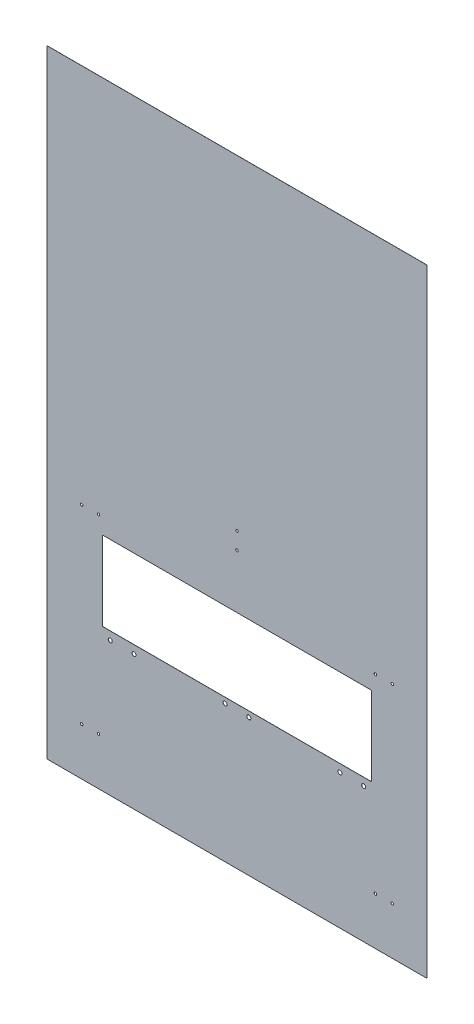
ISO-10303-21;
HEADER;
FILE_DESCRIPTION(('STEP AP214'),'2;1');
FILE_NAME('part.step','',(''),(''),'','','');
FILE_SCHEMA(('AUTOMOTIVE_DESIGN { 1 0 10303 214 1 1 1 1 }'));
ENDSEC;
DATA;
#1=APPLICATION_CONTEXT('core data for automotive mechanical design processes');
#2=APPLICATION_PROTOCOL_DEFINITION('international standard','automotive_design',2000,#1);
#3=PRODUCT_CONTEXT('',#1,'mechanical');
#4=PRODUCT('Part','Part','',(#3));
#5=PRODUCT_RELATED_PRODUCT_CATEGORY('part','',(#4));
#6=PRODUCT_DEFINITION_FORMATION('','',#4);
#7=PRODUCT_DEFINITION_CONTEXT('part definition',#1,'design');
#8=PRODUCT_DEFINITION('design','',#6,#7);
#9=PRODUCT_DEFINITION_SHAPE('','',#8);
#10=(LENGTH_UNIT() NAMED_UNIT(*) SI_UNIT(.MILLI.,.METRE.));
#11=(NAMED_UNIT(*) PLANE_ANGLE_UNIT() SI_UNIT($,.RADIAN.));
#12=(NAMED_UNIT(*) SI_UNIT($,.STERADIAN.) SOLID_ANGLE_UNIT());
#13=UNCERTAINTY_MEASURE_WITH_UNIT(LENGTH_MEASURE(1.E-05),#10,'distance_accuracy_value','');
#14=(GEOMETRIC_REPRESENTATION_CONTEXT(3) GLOBAL_UNCERTAINTY_ASSIGNED_CONTEXT((#13)) GLOBAL_UNIT_ASSIGNED_CONTEXT((#10,
#11,#12)) REPRESENTATION_CONTEXT('',''));
#15=CARTESIAN_POINT('',(0.,0.,0.));
#16=DIRECTION('',(0.,0.,1.));
#17=DIRECTION('',(1.,0.,0.));
#18=AXIS2_PLACEMENT_3D('',#15,#16,#17);
#19=CARTESIAN_POINT('',(0.,0.,6.35));
#20=DIRECTION('',(0.,0.,-1.));
#21=DIRECTION('',(-1.,0.,0.));
#22=AXIS2_PLACEMENT_3D('',#19,#20,#21);
#23=PLANE('',#22);
#24=CARTESIAN_POINT('',(111.5695,762.,6.35));
#25=DIRECTION('',(0.,0.,1.));
#26=DIRECTION('',(1.,0.,0.));
#27=AXIS2_PLACEMENT_3D('',#24,#25,#26);
#28=CIRCLE('',#27,3.96874999999999);
#29=CARTESIAN_POINT('',(115.53825,762.,6.35));
#30=VERTEX_POINT('',#29);
#31=EDGE_CURVE('E277',#30,#30,#28,.T.);
#32=ORIENTED_EDGE('',*,*,#31,.F.);
#33=EDGE_LOOP('',(#32));
#34=FACE_BOUND('',#33,.T.);
#35=CARTESIAN_POINT('',(111.5695,152.4,6.35));
#36=DIRECTION('',(0.,0.,1.));
#37=DIRECTION('',(1.,0.,0.));
#38=AXIS2_PLACEMENT_3D('',#35,#36,#37);
#39=CIRCLE('',#38,3.96874999999999);
#40=CARTESIAN_POINT('',(115.53825,152.4,6.35));
#41=VERTEX_POINT('',#40);
#42=EDGE_CURVE('E280',#41,#41,#39,.T.);
#43=ORIENTED_EDGE('',*,*,#42,.F.);
#44=EDGE_LOOP('',(#43));
#45=FACE_BOUND('',#44,.T.);
#46=CARTESIAN_POINT('',(165.5445,152.4,6.35));
#47=DIRECTION('',(0.,0.,1.));
#48=DIRECTION('',(1.,0.,0.));
#49=AXIS2_PLACEMENT_3D('',#46,#47,#48);
#50=CIRCLE('',#49,3.96874999999999);
#51=CARTESIAN_POINT('',(169.51325,152.4,6.35));
#52=VERTEX_POINT('',#51);
#53=EDGE_CURVE('E283',#52,#52,#50,.T.);
#54=ORIENTED_EDGE('',*,*,#53,.F.);
#55=EDGE_LOOP('',(#54));
#56=FACE_BOUND('',#55,.T.);
#57=CARTESIAN_POINT('',(165.5445,762.,6.35));
#58=DIRECTION('',(0.,0.,1.));
#59=DIRECTION('',(1.,0.,0.));
#60=AXIS2_PLACEMENT_3D('',#57,#58,#59);
#61=CIRCLE('',#60,3.96874999999999);
#62=CARTESIAN_POINT('',(169.51325,762.,6.35));
#63=VERTEX_POINT('',#62);
#64=EDGE_CURVE('E286',#63,#63,#61,.T.);
#65=ORIENTED_EDGE('',*,*,#64,.F.);
#66=EDGE_LOOP('',(#65));
#67=FACE_BOUND('',#66,.T.);
#68=CARTESIAN_POINT('',(1053.6555,152.4,6.35));
#69=DIRECTION('',(0.,0.,1.));
#70=DIRECTION('',(1.,0.,0.));
#71=AXIS2_PLACEMENT_3D('',#68,#69,#70);
#72=CIRCLE('',#71,3.96875000000008);
#73=CARTESIAN_POINT('',(1057.62425,152.4,6.35));
#74=VERTEX_POINT('',#73);
#75=EDGE_CURVE('E289',#74,#74,#72,.T.);
#76=ORIENTED_EDGE('',*,*,#75,.F.);
#77=EDGE_LOOP('',(#76));
#78=FACE_BOUND('',#77,.T.);
#79=CARTESIAN_POINT('',(1107.6305,152.4,6.35));
#80=DIRECTION('',(0.,0.,1.));
#81=DIRECTION('',(1.,0.,0.));
#82=AXIS2_PLACEMENT_3D('',#79,#80,#81);
#83=CIRCLE('',#82,3.96875000000008);
#84=CARTESIAN_POINT('',(1111.59925,152.4,6.35));
#85=VERTEX_POINT('',#84);
#86=EDGE_CURVE('E292',#85,#85,#83,.T.);
#87=ORIENTED_EDGE('',*,*,#86,.F.);
#88=EDGE_LOOP('',(#87));
#89=FACE_BOUND('',#88,.T.);
#90=CARTESIAN_POINT('',(1107.6305,762.,6.35));
#91=DIRECTION('',(0.,0.,1.));
#92=DIRECTION('',(1.,0.,0.));
#93=AXIS2_PLACEMENT_3D('',#90,#91,#92);
#94=CIRCLE('',#93,3.96875000000008);
#95=CARTESIAN_POINT('',(1111.59925,762.,6.35));
#96=VERTEX_POINT('',#95);
#97=EDGE_CURVE('E295',#96,#96,#94,.T.);
#98=ORIENTED_EDGE('',*,*,#97,.F.);
#99=EDGE_LOOP('',(#98));
#100=FACE_BOUND('',#99,.T.);
#101=CARTESIAN_POINT('',(1053.6555,762.,6.35));
#102=DIRECTION('',(0.,0.,1.));
#103=DIRECTION('',(1.,0.,0.));
#104=AXIS2_PLACEMENT_3D('',#101,#102,#103);
#105=CIRCLE('',#104,3.96875000000008);
#106=CARTESIAN_POINT('',(1057.62425,762.,6.35));
#107=VERTEX_POINT('',#106);
#108=EDGE_CURVE('E298',#107,#107,#105,.T.);
#109=ORIENTED_EDGE('',*,*,#108,.F.);
#110=EDGE_LOOP('',(#109));
#111=FACE_BOUND('',#110,.T.);
#112=CARTESIAN_POINT('',(609.6,884.2375,6.35));
#113=DIRECTION('',(0.,0.,1.));
#114=DIRECTION('',(1.,0.,0.));
#115=AXIS2_PLACEMENT_3D('',#112,#113,#114);
#116=CIRCLE('',#115,3.96874999999997);
#117=CARTESIAN_POINT('',(613.56875,884.2375,6.35));
#118=VERTEX_POINT('',#117);
#119=EDGE_CURVE('E301',#118,#118,#116,.T.);
#120=ORIENTED_EDGE('',*,*,#119,.F.);
#121=EDGE_LOOP('',(#120));
#122=FACE_BOUND('',#121,.T.);
#123=CARTESIAN_POINT('',(609.6,938.2125,6.35));
#124=DIRECTION('',(0.,0.,1.));
#125=DIRECTION('',(1.,0.,0.));
#126=AXIS2_PLACEMENT_3D('',#123,#124,#125);
#127=CIRCLE('',#126,3.96874999999997);
#128=CARTESIAN_POINT('',(613.56875,938.2125,6.35));
#129=VERTEX_POINT('',#128);
#130=EDGE_CURVE('E304',#129,#129,#127,.T.);
#131=ORIENTED_EDGE('',*,*,#130,.F.);
#132=EDGE_LOOP('',(#131));
#133=FACE_BOUND('',#132,.T.);
#134=CARTESIAN_POINT('',(203.200000000003,430.929767990845,6.35));
#135=DIRECTION('',(0.,0.,1.));
#136=DIRECTION('',(1.,0.,0.));
#137=AXIS2_PLACEMENT_3D('',#134,#135,#136);
#138=CIRCLE('',#137,6.4389);
#139=CARTESIAN_POINT('',(209.638900000003,430.929767990845,6.35));
#140=VERTEX_POINT('',#139);
#141=EDGE_CURVE('E307',#140,#140,#138,.T.);
#142=ORIENTED_EDGE('',*,*,#141,.F.);
#143=EDGE_LOOP('',(#142));
#144=FACE_BOUND('',#143,.T.);
#145=CARTESIAN_POINT('',(279.400000000004,430.929767990845,6.35));
#146=DIRECTION('',(0.,0.,1.));
#147=DIRECTION('',(1.,0.,0.));
#148=AXIS2_PLACEMENT_3D('',#145,#146,#147);
#149=CIRCLE('',#148,6.43890000000003);
#150=CARTESIAN_POINT('',(285.838900000004,430.929767990845,6.35));
#151=VERTEX_POINT('',#150);
#152=EDGE_CURVE('E310',#151,#151,#149,.T.);
#153=ORIENTED_EDGE('',*,*,#152,.F.);
#154=EDGE_LOOP('',(#153));
#155=FACE_BOUND('',#154,.T.);
#156=CARTESIAN_POINT('',(939.799999999995,432.537135513519,6.35));
#157=DIRECTION('',(0.,0.,1.));
#158=DIRECTION('',(1.,0.,0.));
#159=AXIS2_PLACEMENT_3D('',#156,#157,#158);
#160=CIRCLE('',#159,6.43890000000003);
#161=CARTESIAN_POINT('',(946.238899999995,432.537135513519,6.35));
#162=VERTEX_POINT('',#161);
#163=EDGE_CURVE('E313',#162,#162,#160,.T.);
#164=ORIENTED_EDGE('',*,*,#163,.F.);
#165=EDGE_LOOP('',(#164));
#166=FACE_BOUND('',#165,.T.);
#167=CARTESIAN_POINT('',(1015.99999999999,432.537135513518,6.35));
#168=DIRECTION('',(0.,0.,1.));
#169=DIRECTION('',(1.,0.,0.));
#170=AXIS2_PLACEMENT_3D('',#167,#168,#169);
#171=CIRCLE('',#170,6.43890000000003);
#172=CARTESIAN_POINT('',(1022.43889999999,432.537135513518,6.35));
#173=VERTEX_POINT('',#172);
#174=EDGE_CURVE('E316',#173,#173,#171,.T.);
#175=ORIENTED_EDGE('',*,*,#174,.F.);
#176=EDGE_LOOP('',(#175));
#177=FACE_BOUND('',#176,.T.);
#178=CARTESIAN_POINT('',(571.500000000004,439.533766845285,6.35));
#179=DIRECTION('',(0.,0.,1.));
#180=DIRECTION('',(1.,0.,0.));
#181=AXIS2_PLACEMENT_3D('',#178,#179,#180);
#182=CIRCLE('',#181,6.43890000000003);
#183=CARTESIAN_POINT('',(577.938900000004,439.533766845285,6.35));
#184=VERTEX_POINT('',#183);
#185=EDGE_CURVE('E319',#184,#184,#182,.T.);
#186=ORIENTED_EDGE('',*,*,#185,.F.);
#187=EDGE_LOOP('',(#186));
#188=FACE_BOUND('',#187,.T.);
#189=CARTESIAN_POINT('',(647.700000000004,439.533766845285,6.35));
#190=DIRECTION('',(0.,0.,1.));
#191=DIRECTION('',(1.,0.,0.));
#192=AXIS2_PLACEMENT_3D('',#189,#190,#191);
#193=CIRCLE('',#192,6.43890000000003);
#194=CARTESIAN_POINT('',(654.138900000004,439.533766845285,6.35));
#195=VERTEX_POINT('',#194);
#196=EDGE_CURVE('E234',#195,#195,#193,.T.);
#197=ORIENTED_EDGE('',*,*,#196,.F.);
#198=EDGE_LOOP('',(#197));
#199=FACE_BOUND('',#198,.T.);
#200=DIRECTION('',(0.,1.,0.));
#201=VECTOR('',#200,1.);
#202=CARTESIAN_POINT('',(1219.2,0.,6.35));
#203=LINE('',#202,#201);
#204=CARTESIAN_POINT('',(1219.2,3.175,6.35));
#205=VERTEX_POINT('',#204);
#206=CARTESIAN_POINT('',(1219.2,1978.025,6.35));
#207=VERTEX_POINT('',#206);
#208=EDGE_CURVE('E337',#205,#207,#203,.T.);
#209=ORIENTED_EDGE('',*,*,#208,.T.);
#210=CARTESIAN_POINT('',(1216.025,1978.025,6.35));
#211=DIRECTION('',(0.,0.,-1.));
#212=DIRECTION('',(-1.,0.,0.));
#213=AXIS2_PLACEMENT_3D('',#210,#211,#212);
#214=CIRCLE('',#213,3.175);
#215=CARTESIAN_POINT('',(1216.025,1981.2,6.35));
#216=VERTEX_POINT('',#215);
#217=EDGE_CURVE('E171',#207,#216,#214,.F.);
#218=ORIENTED_EDGE('',*,*,#217,.T.);
#219=DIRECTION('',(-1.,0.,0.));
#220=VECTOR('',#219,1.);
#221=CARTESIAN_POINT('',(0.,1981.2,6.35));
#222=LINE('',#221,#220);
#223=CARTESIAN_POINT('',(3.175,1981.2,6.35));
#224=VERTEX_POINT('',#223);
#225=EDGE_CURVE('E339',#216,#224,#222,.T.);
#226=ORIENTED_EDGE('',*,*,#225,.T.);
#227=CARTESIAN_POINT('',(3.175,1978.025,6.35));
#228=DIRECTION('',(0.,0.,-1.));
#229=DIRECTION('',(-1.,0.,0.));
#230=AXIS2_PLACEMENT_3D('',#227,#228,#229);
#231=CIRCLE('',#230,3.175);
#232=CARTESIAN_POINT('',(0.,1978.025,6.35));
#233=VERTEX_POINT('',#232);
#234=EDGE_CURVE('E181',#224,#233,#231,.F.);
#235=ORIENTED_EDGE('',*,*,#234,.T.);
#236=DIRECTION('',(0.,-1.,0.));
#237=VECTOR('',#236,1.);
#238=CARTESIAN_POINT('',(0.,0.,6.35));
#239=LINE('',#238,#237);
#240=CARTESIAN_POINT('',(0.,3.175,6.35));
#241=VERTEX_POINT('',#240);
#242=EDGE_CURVE('E331',#233,#241,#239,.T.);
#243=ORIENTED_EDGE('',*,*,#242,.T.);
#244=CARTESIAN_POINT('',(3.175,3.175,6.35));
#245=DIRECTION('',(0.,0.,-1.));
#246=DIRECTION('',(-1.,0.,0.));
#247=AXIS2_PLACEMENT_3D('',#244,#245,#246);
#248=CIRCLE('',#247,3.175);
#249=CARTESIAN_POINT('',(3.175,0.,6.35));
#250=VERTEX_POINT('',#249);
#251=EDGE_CURVE('E174',#241,#250,#248,.F.);
#252=ORIENTED_EDGE('',*,*,#251,.T.);
#253=DIRECTION('',(1.,0.,0.));
#254=VECTOR('',#253,1.);
#255=CARTESIAN_POINT('',(0.,0.,6.35));
#256=LINE('',#255,#254);
#257=CARTESIAN_POINT('',(1216.025,0.,6.35));
#258=VERTEX_POINT('',#257);
#259=EDGE_CURVE('E334',#250,#258,#256,.T.);
#260=ORIENTED_EDGE('',*,*,#259,.T.);
#261=CARTESIAN_POINT('',(1216.025,3.175,6.35));
#262=DIRECTION('',(0.,0.,-1.));
#263=DIRECTION('',(-1.,0.,0.));
#264=AXIS2_PLACEMENT_3D('',#261,#262,#263);
#265=CIRCLE('',#264,3.175);
#266=EDGE_CURVE('E172',#258,#205,#265,.F.);
#267=ORIENTED_EDGE('',*,*,#266,.T.);
#268=EDGE_LOOP('',(#209,#218,#226,#235,#243,#252,#260,#267));
#269=FACE_BOUND('',#268,.T.);
#270=DIRECTION('',(0.,-1.,0.));
#271=VECTOR('',#270,1.);
#272=CARTESIAN_POINT('',(177.8,457.2,6.35));
#273=LINE('',#272,#271);
#274=CARTESIAN_POINT('',(177.8,708.025,6.35));
#275=VERTEX_POINT('',#274);
#276=CARTESIAN_POINT('',(177.8,460.375,6.35));
#277=VERTEX_POINT('',#276);
#278=EDGE_CURVE('E223',#275,#277,#273,.T.);
#279=ORIENTED_EDGE('',*,*,#278,.F.);
#280=CARTESIAN_POINT('',(180.975,708.025,6.35));
#281=DIRECTION('',(0.,0.,-1.));
#282=DIRECTION('',(-1.,0.,0.));
#283=AXIS2_PLACEMENT_3D('',#280,#281,#282);
#284=CIRCLE('',#283,3.175);
#285=CARTESIAN_POINT('',(180.975,711.2,6.35));
#286=VERTEX_POINT('',#285);
#287=EDGE_CURVE('E11',#275,#286,#284,.T.);
#288=ORIENTED_EDGE('',*,*,#287,.T.);
#289=DIRECTION('',(-1.,0.,0.));
#290=VECTOR('',#289,1.);
#291=CARTESIAN_POINT('',(177.8,711.2,6.35));
#292=LINE('',#291,#290);
#293=CARTESIAN_POINT('',(1038.225,711.2,6.35));
#294=VERTEX_POINT('',#293);
#295=EDGE_CURVE('E328',#294,#286,#292,.T.);
#296=ORIENTED_EDGE('',*,*,#295,.F.);
#297=CARTESIAN_POINT('',(1038.225,708.025,6.35));
#298=DIRECTION('',(0.,0.,-1.));
#299=DIRECTION('',(-1.,0.,0.));
#300=AXIS2_PLACEMENT_3D('',#297,#298,#299);
#301=CIRCLE('',#300,3.175);
#302=CARTESIAN_POINT('',(1041.4,708.025,6.35));
#303=VERTEX_POINT('',#302);
#304=EDGE_CURVE('E216',#294,#303,#301,.T.);
#305=ORIENTED_EDGE('',*,*,#304,.T.);
#306=DIRECTION('',(0.,1.,0.));
#307=VECTOR('',#306,1.);
#308=CARTESIAN_POINT('',(1041.4,457.2,6.35));
#309=LINE('',#308,#307);
#310=CARTESIAN_POINT('',(1041.4,460.375,6.35));
#311=VERTEX_POINT('',#310);
#312=EDGE_CURVE('E325',#311,#303,#309,.T.);
#313=ORIENTED_EDGE('',*,*,#312,.F.);
#314=CARTESIAN_POINT('',(1038.225,460.375,6.35));
#315=DIRECTION('',(0.,0.,-1.));
#316=DIRECTION('',(-1.,0.,0.));
#317=AXIS2_PLACEMENT_3D('',#314,#315,#316);
#318=CIRCLE('',#317,3.175);
#319=CARTESIAN_POINT('',(1038.225,457.2,6.35));
#320=VERTEX_POINT('',#319);
#321=EDGE_CURVE('E214',#311,#320,#318,.T.);
#322=ORIENTED_EDGE('',*,*,#321,.T.);
#323=DIRECTION('',(1.,0.,0.));
#324=VECTOR('',#323,1.);
#325=CARTESIAN_POINT('',(177.8,457.2,6.35));
#326=LINE('',#325,#324);
#327=CARTESIAN_POINT('',(180.975,457.2,6.35));
#328=VERTEX_POINT('',#327);
#329=EDGE_CURVE('E226',#328,#320,#326,.T.);
#330=ORIENTED_EDGE('',*,*,#329,.F.);
#331=CARTESIAN_POINT('',(180.975,460.375,6.35));
#332=DIRECTION('',(0.,0.,-1.));
#333=DIRECTION('',(-1.,0.,0.));
#334=AXIS2_PLACEMENT_3D('',#331,#332,#333);
#335=CIRCLE('',#334,3.175);
#336=EDGE_CURVE('E45',#328,#277,#335,.T.);
#337=ORIENTED_EDGE('',*,*,#336,.T.);
#338=EDGE_LOOP('',(#279,#288,#296,#305,#313,#322,#330,#337));
#339=FACE_BOUND('',#338,.T.);
#340=ADVANCED_FACE('F36',(#34,#45,#56,#67,#78,#89,#100,#111,#122,#133,#144,#155,#166,#177,#188,
#199,#269,#339),#23,.F.);
#341=CARTESIAN_POINT('',(0.,0.,6.35));
#342=DIRECTION('',(1.,0.,0.));
#343=DIRECTION('',(0.,0.,-1.));
#344=AXIS2_PLACEMENT_3D('',#341,#342,#343);
#345=PLANE('',#344);
#346=DIRECTION('',(0.,0.,-1.));
#347=VECTOR('',#346,1.);
#348=CARTESIAN_POINT('',(0.,1978.025,6.35));
#349=LINE('',#348,#347);
#350=CARTESIAN_POINT('',(0.,1978.025,6.09599999999986));
#351=VERTEX_POINT('',#350);
#352=EDGE_CURVE('E186',#233,#351,#349,.T.);
#353=ORIENTED_EDGE('',*,*,#352,.T.);
#354=DIRECTION('',(0.,-1.,0.));
#355=VECTOR('',#354,1.);
#356=CARTESIAN_POINT('',(0.,1981.2,6.09599999999986));
#357=LINE('',#356,#355);
#358=CARTESIAN_POINT('',(0.,3.17499999999993,6.09599999999961));
#359=VERTEX_POINT('',#358);
#360=EDGE_CURVE('E167',#351,#359,#357,.T.);
#361=ORIENTED_EDGE('',*,*,#360,.T.);
#362=DIRECTION('',(0.,0.,-1.));
#363=VECTOR('',#362,1.);
#364=CARTESIAN_POINT('',(0.,3.175,6.35));
#365=LINE('',#364,#363);
#366=EDGE_CURVE('E184',#359,#241,#365,.F.);
#367=ORIENTED_EDGE('',*,*,#366,.T.);
#368=ORIENTED_EDGE('',*,*,#242,.F.);
#369=EDGE_LOOP('',(#353,#361,#367,#368));
#370=FACE_BOUND('',#369,.T.);
#371=ADVANCED_FACE('F356',(#370),#345,.F.);
#372=CARTESIAN_POINT('',(0.,0.,6.35));
#373=DIRECTION('',(0.,1.,0.));
#374=DIRECTION('',(0.,0.,1.));
#375=AXIS2_PLACEMENT_3D('',#372,#373,#374);
#376=PLANE('',#375);
#377=DIRECTION('',(0.,0.,-1.));
#378=VECTOR('',#377,1.);
#379=CARTESIAN_POINT('',(3.175,0.,6.35));
#380=LINE('',#379,#378);
#381=CARTESIAN_POINT('',(3.175,0.,6.09599999999961));
#382=VERTEX_POINT('',#381);
#383=EDGE_CURVE('E191',#250,#382,#380,.T.);
#384=ORIENTED_EDGE('',*,*,#383,.T.);
#385=DIRECTION('',(1.,0.,0.));
#386=VECTOR('',#385,1.);
#387=CARTESIAN_POINT('',(0.,0.,6.09599999999961));
#388=LINE('',#387,#386);
#389=CARTESIAN_POINT('',(1216.025,0.,6.09599999999961));
#390=VERTEX_POINT('',#389);
#391=EDGE_CURVE('E367',#382,#390,#388,.T.);
#392=ORIENTED_EDGE('',*,*,#391,.T.);
#393=DIRECTION('',(0.,0.,-1.));
#394=VECTOR('',#393,1.);
#395=CARTESIAN_POINT('',(1216.025,0.,6.35));
#396=LINE('',#395,#394);
#397=EDGE_CURVE('E189',#390,#258,#396,.F.);
#398=ORIENTED_EDGE('',*,*,#397,.T.);
#399=ORIENTED_EDGE('',*,*,#259,.F.);
#400=EDGE_LOOP('',(#384,#392,#398,#399));
#401=FACE_BOUND('',#400,.T.);
#402=ADVANCED_FACE('F366',(#401),#376,.F.);
#403=CARTESIAN_POINT('',(1219.2,0.,6.35));
#404=DIRECTION('',(-1.,0.,0.));
#405=DIRECTION('',(0.,0.,1.));
#406=AXIS2_PLACEMENT_3D('',#403,#404,#405);
#407=PLANE('',#406);
#408=DIRECTION('',(0.,0.,-1.));
#409=VECTOR('',#408,1.);
#410=CARTESIAN_POINT('',(1219.2,3.175,6.35));
#411=LINE('',#410,#409);
#412=CARTESIAN_POINT('',(1219.2,3.175,6.09599999999973));
#413=VERTEX_POINT('',#412);
#414=EDGE_CURVE('E166',#205,#413,#411,.T.);
#415=ORIENTED_EDGE('',*,*,#414,.T.);
#416=DIRECTION('',(0.,-1.,0.));
#417=VECTOR('',#416,1.);
#418=CARTESIAN_POINT('',(1219.2,1981.2,6.09599999999986));
#419=LINE('',#418,#417);
#420=CARTESIAN_POINT('',(1219.2,1978.025,6.09599999999986));
#421=VERTEX_POINT('',#420);
#422=EDGE_CURVE('E52',#421,#413,#419,.T.);
#423=ORIENTED_EDGE('',*,*,#422,.F.);
#424=DIRECTION('',(0.,0.,-1.));
#425=VECTOR('',#424,1.);
#426=CARTESIAN_POINT('',(1219.2,1978.025,6.35));
#427=LINE('',#426,#425);
#428=EDGE_CURVE('E163',#421,#207,#427,.F.);
#429=ORIENTED_EDGE('',*,*,#428,.T.);
#430=ORIENTED_EDGE('',*,*,#208,.F.);
#431=EDGE_LOOP('',(#415,#423,#429,#430));
#432=FACE_BOUND('',#431,.T.);
#433=ADVANCED_FACE('F161',(#432),#407,.F.);
#434=CARTESIAN_POINT('',(0.,1981.2,6.35));
#435=DIRECTION('',(0.,-1.,0.));
#436=DIRECTION('',(0.,0.,-1.));
#437=AXIS2_PLACEMENT_3D('',#434,#435,#436);
#438=PLANE('',#437);
#439=DIRECTION('',(0.,0.,-1.));
#440=VECTOR('',#439,1.);
#441=CARTESIAN_POINT('',(1216.025,1981.2,6.35));
#442=LINE('',#441,#440);
#443=CARTESIAN_POINT('',(1216.025,1981.2,6.09599999999986));
#444=VERTEX_POINT('',#443);
#445=EDGE_CURVE('E176',#216,#444,#442,.T.);
#446=ORIENTED_EDGE('',*,*,#445,.T.);
#447=DIRECTION('',(1.,0.,0.));
#448=VECTOR('',#447,1.);
#449=CARTESIAN_POINT('',(0.,1981.2,6.09599999999986));
#450=LINE('',#449,#448);
#451=CARTESIAN_POINT('',(3.175,1981.2,6.09599999999986));
#452=VERTEX_POINT('',#451);
#453=EDGE_CURVE('E151',#452,#444,#450,.T.);
#454=ORIENTED_EDGE('',*,*,#453,.F.);
#455=DIRECTION('',(0.,0.,-1.));
#456=VECTOR('',#455,1.);
#457=CARTESIAN_POINT('',(3.175,1981.2,6.35));
#458=LINE('',#457,#456);
#459=EDGE_CURVE('E342',#452,#224,#458,.F.);
#460=ORIENTED_EDGE('',*,*,#459,.T.);
#461=ORIENTED_EDGE('',*,*,#225,.F.);
#462=EDGE_LOOP('',(#446,#454,#460,#461));
#463=FACE_BOUND('',#462,.T.);
#464=ADVANCED_FACE('F345',(#463),#438,.F.);
#465=CARTESIAN_POINT('',(177.8,457.2,6.35));
#466=DIRECTION('',(1.,0.,0.));
#467=DIRECTION('',(0.,1.,0.));
#468=AXIS2_PLACEMENT_3D('',#465,#466,#467);
#469=PLANE('',#468);
#470=DIRECTION('',(0.,-1.,0.));
#471=VECTOR('',#470,1.);
#472=CARTESIAN_POINT('',(177.8,457.2,6.09599999999967));
#473=LINE('',#472,#471);
#474=CARTESIAN_POINT('',(177.8,708.025,6.0959999999997));
#475=VERTEX_POINT('',#474);
#476=CARTESIAN_POINT('',(177.8,460.375,6.09599999999967));
#477=VERTEX_POINT('',#476);
#478=EDGE_CURVE('E241',#475,#477,#473,.T.);
#479=ORIENTED_EDGE('',*,*,#478,.F.);
#480=DIRECTION('',(0.,0.,-1.));
#481=VECTOR('',#480,1.);
#482=CARTESIAN_POINT('',(177.8,708.025,6.35));
#483=LINE('',#482,#481);
#484=EDGE_CURVE('E209',#475,#275,#483,.F.);
#485=ORIENTED_EDGE('',*,*,#484,.T.);
#486=ORIENTED_EDGE('',*,*,#278,.T.);
#487=DIRECTION('',(0.,0.,-1.));
#488=VECTOR('',#487,1.);
#489=CARTESIAN_POINT('',(177.8,460.375,0.));
#490=LINE('',#489,#488);
#491=EDGE_CURVE('E211',#277,#477,#490,.T.);
#492=ORIENTED_EDGE('',*,*,#491,.T.);
#493=EDGE_LOOP('',(#479,#485,#486,#492));
#494=FACE_BOUND('',#493,.T.);
#495=ADVANCED_FACE('F232',(#494),#469,.T.);
#496=CARTESIAN_POINT('',(177.8,457.2,6.35));
#497=DIRECTION('',(0.,1.,0.));
#498=DIRECTION('',(0.,0.,1.));
#499=AXIS2_PLACEMENT_3D('',#496,#497,#498);
#500=PLANE('',#499);
#501=DIRECTION('',(1.,0.,0.));
#502=VECTOR('',#501,1.);
#503=CARTESIAN_POINT('',(177.8,457.2,6.09599999999967));
#504=LINE('',#503,#502);
#505=CARTESIAN_POINT('',(180.975,457.2,6.09599999999967));
#506=VERTEX_POINT('',#505);
#507=CARTESIAN_POINT('',(1038.225,457.2,6.09599999999967));
#508=VERTEX_POINT('',#507);
#509=EDGE_CURVE('E250',#506,#508,#504,.T.);
#510=ORIENTED_EDGE('',*,*,#509,.F.);
#511=DIRECTION('',(0.,0.,-1.));
#512=VECTOR('',#511,1.);
#513=CARTESIAN_POINT('',(180.975,457.2,6.35));
#514=LINE('',#513,#512);
#515=EDGE_CURVE('E194',#506,#328,#514,.F.);
#516=ORIENTED_EDGE('',*,*,#515,.T.);
#517=ORIENTED_EDGE('',*,*,#329,.T.);
#518=DIRECTION('',(0.,0.,-1.));
#519=VECTOR('',#518,1.);
#520=CARTESIAN_POINT('',(1038.225,457.2,0.));
#521=LINE('',#520,#519);
#522=EDGE_CURVE('E196',#320,#508,#521,.T.);
#523=ORIENTED_EDGE('',*,*,#522,.T.);
#524=EDGE_LOOP('',(#510,#516,#517,#523));
#525=FACE_BOUND('',#524,.T.);
#526=ADVANCED_FACE('F425',(#525),#500,.T.);
#527=CARTESIAN_POINT('',(1041.4,457.2,6.35));
#528=DIRECTION('',(-1.,0.,0.));
#529=DIRECTION('',(0.,0.,1.));
#530=AXIS2_PLACEMENT_3D('',#527,#528,#529);
#531=PLANE('',#530);
#532=DIRECTION('',(0.,1.,0.));
#533=VECTOR('',#532,1.);
#534=CARTESIAN_POINT('',(1041.4,457.2,6.09599999999967));
#535=LINE('',#534,#533);
#536=CARTESIAN_POINT('',(1041.4,460.375,6.09599999999967));
#537=VERTEX_POINT('',#536);
#538=CARTESIAN_POINT('',(1041.4,708.025,6.0959999999997));
#539=VERTEX_POINT('',#538);
#540=EDGE_CURVE('E244',#537,#539,#535,.T.);
#541=ORIENTED_EDGE('',*,*,#540,.F.);
#542=DIRECTION('',(0.,0.,-1.));
#543=VECTOR('',#542,1.);
#544=CARTESIAN_POINT('',(1041.4,460.375,6.35));
#545=LINE('',#544,#543);
#546=EDGE_CURVE('E202',#537,#311,#545,.F.);
#547=ORIENTED_EDGE('',*,*,#546,.T.);
#548=ORIENTED_EDGE('',*,*,#312,.T.);
#549=DIRECTION('',(0.,0.,-1.));
#550=VECTOR('',#549,1.);
#551=CARTESIAN_POINT('',(1041.4,708.025,0.));
#552=LINE('',#551,#550);
#553=EDGE_CURVE('E199',#303,#539,#552,.T.);
#554=ORIENTED_EDGE('',*,*,#553,.T.);
#555=EDGE_LOOP('',(#541,#547,#548,#554));
#556=FACE_BOUND('',#555,.T.);
#557=ADVANCED_FACE('F418',(#556),#531,.T.);
#558=CARTESIAN_POINT('',(177.8,711.2,6.35));
#559=DIRECTION('',(0.,-1.,0.));
#560=DIRECTION('',(0.,0.,-1.));
#561=AXIS2_PLACEMENT_3D('',#558,#559,#560);
#562=PLANE('',#561);
#563=DIRECTION('',(-1.,0.,0.));
#564=VECTOR('',#563,1.);
#565=CARTESIAN_POINT('',(177.8,711.2,6.0959999999997));
#566=LINE('',#565,#564);
#567=CARTESIAN_POINT('',(1038.225,711.2,6.0959999999997));
#568=VERTEX_POINT('',#567);
#569=CARTESIAN_POINT('',(180.975,711.2,6.0959999999997));
#570=VERTEX_POINT('',#569);
#571=EDGE_CURVE('E60',#568,#570,#566,.T.);
#572=ORIENTED_EDGE('',*,*,#571,.F.);
#573=DIRECTION('',(0.,0.,-1.));
#574=VECTOR('',#573,1.);
#575=CARTESIAN_POINT('',(1038.225,711.2,6.35));
#576=LINE('',#575,#574);
#577=EDGE_CURVE('E207',#568,#294,#576,.F.);
#578=ORIENTED_EDGE('',*,*,#577,.T.);
#579=ORIENTED_EDGE('',*,*,#295,.T.);
#580=DIRECTION('',(0.,0.,-1.));
#581=VECTOR('',#580,1.);
#582=CARTESIAN_POINT('',(180.975,711.2,0.));
#583=LINE('',#582,#581);
#584=EDGE_CURVE('E204',#286,#570,#583,.T.);
#585=ORIENTED_EDGE('',*,*,#584,.T.);
#586=EDGE_LOOP('',(#572,#578,#579,#585));
#587=FACE_BOUND('',#586,.T.);
#588=ADVANCED_FACE('F408',(#587),#562,.T.);
#589=CARTESIAN_POINT('',(647.700000000004,439.533766845285,6.35));
#590=DIRECTION('',(0.,0.,1.));
#591=DIRECTION('',(1.,0.,0.));
#592=AXIS2_PLACEMENT_3D('',#589,#590,#591);
#593=CONICAL_SURFACE('',#592,6.43890000000003,0.715584993317683);
#594=CARTESIAN_POINT('',(647.700000000004,439.533766845285,6.09599999999967));
#595=DIRECTION('',(0.,0.,1.));
#596=DIRECTION('',(0.,-1.,0.));
#597=AXIS2_PLACEMENT_3D('',#594,#595,#596);
#598=CIRCLE('',#597,6.21810116859441);
#599=CARTESIAN_POINT('',(647.700000000004,433.315665676691,6.09599999999967));
#600=VERTEX_POINT('',#599);
#601=EDGE_CURVE('E274',#600,#600,#598,.F.);
#602=ORIENTED_EDGE('',*,*,#601,.T.);
#603=EDGE_LOOP('',(#602));
#604=FACE_BOUND('',#603,.T.);
#605=ORIENTED_EDGE('',*,*,#196,.T.);
#606=EDGE_LOOP('',(#605));
#607=FACE_BOUND('',#606,.T.);
#608=ADVANCED_FACE('F437',(#604,#607),#593,.F.);
#609=CARTESIAN_POINT('',(571.500000000004,439.533766845285,6.35));
#610=DIRECTION('',(0.,0.,1.));
#611=DIRECTION('',(1.,0.,0.));
#612=AXIS2_PLACEMENT_3D('',#609,#610,#611);
#613=CONICAL_SURFACE('',#612,6.43890000000003,0.715584993317683);
#614=CARTESIAN_POINT('',(571.500000000004,439.533766845285,6.09599999999967));
#615=DIRECTION('',(0.,0.,1.));
#616=DIRECTION('',(0.,-1.,0.));
#617=AXIS2_PLACEMENT_3D('',#614,#615,#616);
#618=CIRCLE('',#617,6.21810116859441);
#619=CARTESIAN_POINT('',(571.500000000004,433.315665676691,6.09599999999967));
#620=VERTEX_POINT('',#619);
#621=EDGE_CURVE('E271',#620,#620,#618,.F.);
#622=ORIENTED_EDGE('',*,*,#621,.T.);
#623=EDGE_LOOP('',(#622));
#624=FACE_BOUND('',#623,.T.);
#625=ORIENTED_EDGE('',*,*,#185,.T.);
#626=EDGE_LOOP('',(#625));
#627=FACE_BOUND('',#626,.T.);
#628=ADVANCED_FACE('F440',(#624,#627),#613,.F.);
#629=CARTESIAN_POINT('',(1015.99999999999,432.537135513518,6.35));
#630=DIRECTION('',(0.,0.,1.));
#631=DIRECTION('',(1.,0.,0.));
#632=AXIS2_PLACEMENT_3D('',#629,#630,#631);
#633=CONICAL_SURFACE('',#632,6.43890000000003,0.715584993317664);
#634=CARTESIAN_POINT('',(1015.99999999999,432.537135513518,6.09599999999967));
#635=DIRECTION('',(0.,0.,1.));
#636=DIRECTION('',(0.,-1.,0.));
#637=AXIS2_PLACEMENT_3D('',#634,#635,#636);
#638=CIRCLE('',#637,6.21810116859442);
#639=CARTESIAN_POINT('',(1015.99999999999,426.319034344924,6.09599999999967));
#640=VERTEX_POINT('',#639);
#641=EDGE_CURVE('E268',#640,#640,#638,.F.);
#642=ORIENTED_EDGE('',*,*,#641,.T.);
#643=EDGE_LOOP('',(#642));
#644=FACE_BOUND('',#643,.T.);
#645=ORIENTED_EDGE('',*,*,#174,.T.);
#646=EDGE_LOOP('',(#645));
#647=FACE_BOUND('',#646,.T.);
#648=ADVANCED_FACE('F506',(#644,#647),#633,.F.);
#649=CARTESIAN_POINT('',(939.799999999995,432.537135513519,6.35));
#650=DIRECTION('',(0.,0.,1.));
#651=DIRECTION('',(1.,0.,0.));
#652=AXIS2_PLACEMENT_3D('',#649,#650,#651);
#653=CONICAL_SURFACE('',#652,6.43890000000003,0.715584993317683);
#654=CARTESIAN_POINT('',(939.799999999995,432.537135513519,6.09599999999967));
#655=DIRECTION('',(0.,0.,1.));
#656=DIRECTION('',(0.,-1.,0.));
#657=AXIS2_PLACEMENT_3D('',#654,#655,#656);
#658=CIRCLE('',#657,6.21810116859441);
#659=CARTESIAN_POINT('',(939.799999999995,426.319034344924,6.09599999999967));
#660=VERTEX_POINT('',#659);
#661=EDGE_CURVE('E265',#660,#660,#658,.F.);
#662=ORIENTED_EDGE('',*,*,#661,.T.);
#663=EDGE_LOOP('',(#662));
#664=FACE_BOUND('',#663,.T.);
#665=ORIENTED_EDGE('',*,*,#163,.T.);
#666=EDGE_LOOP('',(#665));
#667=FACE_BOUND('',#666,.T.);
#668=ADVANCED_FACE('F502',(#664,#667),#653,.F.);
#669=CARTESIAN_POINT('',(279.400000000004,430.929767990845,6.35));
#670=DIRECTION('',(0.,0.,1.));
#671=DIRECTION('',(1.,0.,0.));
#672=AXIS2_PLACEMENT_3D('',#669,#670,#671);
#673=CONICAL_SURFACE('',#672,6.43890000000003,0.715584993317683);
#674=CARTESIAN_POINT('',(279.400000000004,430.929767990845,6.09599999999967));
#675=DIRECTION('',(0.,0.,1.));
#676=DIRECTION('',(0.,-1.,0.));
#677=AXIS2_PLACEMENT_3D('',#674,#675,#676);
#678=CIRCLE('',#677,6.21810116859441);
#679=CARTESIAN_POINT('',(279.400000000004,424.711666822251,6.09599999999967));
#680=VERTEX_POINT('',#679);
#681=EDGE_CURVE('E262',#680,#680,#678,.F.);
#682=ORIENTED_EDGE('',*,*,#681,.T.);
#683=EDGE_LOOP('',(#682));
#684=FACE_BOUND('',#683,.T.);
#685=ORIENTED_EDGE('',*,*,#152,.T.);
#686=EDGE_LOOP('',(#685));
#687=FACE_BOUND('',#686,.T.);
#688=ADVANCED_FACE('F498',(#684,#687),#673,.F.);
#689=CARTESIAN_POINT('',(203.200000000003,430.929767990845,6.35));
#690=DIRECTION('',(0.,0.,1.));
#691=DIRECTION('',(1.,0.,0.));
#692=AXIS2_PLACEMENT_3D('',#689,#690,#691);
#693=CONICAL_SURFACE('',#692,6.4389,0.715584993317674);
#694=CARTESIAN_POINT('',(203.200000000003,430.929767990845,6.09599999999967));
#695=DIRECTION('',(0.,0.,1.));
#696=DIRECTION('',(0.,-1.,0.));
#697=AXIS2_PLACEMENT_3D('',#694,#695,#696);
#698=CIRCLE('',#697,6.21810116859438);
#699=CARTESIAN_POINT('',(203.200000000003,424.711666822251,6.09599999999967));
#700=VERTEX_POINT('',#699);
#701=EDGE_CURVE('E156',#700,#700,#698,.F.);
#702=ORIENTED_EDGE('',*,*,#701,.T.);
#703=EDGE_LOOP('',(#702));
#704=FACE_BOUND('',#703,.T.);
#705=ORIENTED_EDGE('',*,*,#141,.T.);
#706=EDGE_LOOP('',(#705));
#707=FACE_BOUND('',#706,.T.);
#708=ADVANCED_FACE('F466',(#704,#707),#693,.F.);
#709=CARTESIAN_POINT('',(1216.025,1978.025,6.35));
#710=DIRECTION('',(0.,0.,-1.));
#711=DIRECTION('',(-1.,0.,0.));
#712=AXIS2_PLACEMENT_3D('',#709,#710,#711);
#713=CYLINDRICAL_SURFACE('',#712,3.175);
#714=CARTESIAN_POINT('',(1216.025,1978.025,6.09599999999986));
#715=DIRECTION('',(0.,0.,1.));
#716=DIRECTION('',(0.,-1.,0.));
#717=AXIS2_PLACEMENT_3D('',#714,#715,#716);
#718=CIRCLE('',#717,3.175);
#719=EDGE_CURVE('E147',#444,#421,#718,.F.);
#720=ORIENTED_EDGE('',*,*,#719,.F.);
#721=ORIENTED_EDGE('',*,*,#445,.F.);
#722=ORIENTED_EDGE('',*,*,#217,.F.);
#723=ORIENTED_EDGE('',*,*,#428,.F.);
#724=EDGE_LOOP('',(#720,#721,#722,#723));
#725=FACE_BOUND('',#724,.T.);
#726=ADVANCED_FACE('F170',(#725),#713,.T.);
#727=CARTESIAN_POINT('',(3.175,1978.025,6.35));
#728=DIRECTION('',(0.,0.,-1.));
#729=DIRECTION('',(-1.,0.,0.));
#730=AXIS2_PLACEMENT_3D('',#727,#728,#729);
#731=CYLINDRICAL_SURFACE('',#730,3.175);
#732=CARTESIAN_POINT('',(3.175,1978.025,6.09599999999986));
#733=DIRECTION('',(0.,0.,1.));
#734=DIRECTION('',(0.,-1.,0.));
#735=AXIS2_PLACEMENT_3D('',#732,#733,#734);
#736=CIRCLE('',#735,3.175);
#737=EDGE_CURVE('E157',#351,#452,#736,.F.);
#738=ORIENTED_EDGE('',*,*,#737,.F.);
#739=ORIENTED_EDGE('',*,*,#352,.F.);
#740=ORIENTED_EDGE('',*,*,#234,.F.);
#741=ORIENTED_EDGE('',*,*,#459,.F.);
#742=EDGE_LOOP('',(#738,#739,#740,#741));
#743=FACE_BOUND('',#742,.T.);
#744=ADVANCED_FACE('F353',(#743),#731,.T.);
#745=CARTESIAN_POINT('',(3.175,3.175,6.35));
#746=DIRECTION('',(0.,0.,-1.));
#747=DIRECTION('',(-1.,0.,0.));
#748=AXIS2_PLACEMENT_3D('',#745,#746,#747);
#749=CYLINDRICAL_SURFACE('',#748,3.175);
#750=CARTESIAN_POINT('',(3.175,3.175,6.09599999999961));
#751=DIRECTION('',(0.,0.,1.));
#752=DIRECTION('',(0.,-1.,0.));
#753=AXIS2_PLACEMENT_3D('',#750,#751,#752);
#754=CIRCLE('',#753,3.175);
#755=EDGE_CURVE('E257',#382,#359,#754,.F.);
#756=ORIENTED_EDGE('',*,*,#755,.F.);
#757=ORIENTED_EDGE('',*,*,#383,.F.);
#758=ORIENTED_EDGE('',*,*,#251,.F.);
#759=ORIENTED_EDGE('',*,*,#366,.F.);
#760=EDGE_LOOP('',(#756,#757,#758,#759));
#761=FACE_BOUND('',#760,.T.);
#762=ADVANCED_FACE('F363',(#761),#749,.T.);
#763=CARTESIAN_POINT('',(1216.025,3.175,6.35));
#764=DIRECTION('',(0.,0.,-1.));
#765=DIRECTION('',(-1.,0.,0.));
#766=AXIS2_PLACEMENT_3D('',#763,#764,#765);
#767=CYLINDRICAL_SURFACE('',#766,3.175);
#768=CARTESIAN_POINT('',(1216.025,3.175,6.09599999999961));
#769=DIRECTION('',(0.,0.,1.));
#770=DIRECTION('',(0.,-1.,0.));
#771=AXIS2_PLACEMENT_3D('',#768,#769,#770);
#772=CIRCLE('',#771,3.175);
#773=EDGE_CURVE('E255',#413,#390,#772,.F.);
#774=ORIENTED_EDGE('',*,*,#773,.F.);
#775=ORIENTED_EDGE('',*,*,#414,.F.);
#776=ORIENTED_EDGE('',*,*,#266,.F.);
#777=ORIENTED_EDGE('',*,*,#397,.F.);
#778=EDGE_LOOP('',(#774,#775,#776,#777));
#779=FACE_BOUND('',#778,.T.);
#780=ADVANCED_FACE('F371',(#779),#767,.T.);
#781=CARTESIAN_POINT('',(1038.225,460.375,6.35));
#782=DIRECTION('',(0.,0.,1.));
#783=DIRECTION('',(1.,0.,0.));
#784=AXIS2_PLACEMENT_3D('',#781,#782,#783);
#785=CYLINDRICAL_SURFACE('',#784,3.175);
#786=ORIENTED_EDGE('',*,*,#546,.F.);
#787=CARTESIAN_POINT('',(1038.225,460.375,6.09599999999967));
#788=DIRECTION('',(0.,0.,1.));
#789=DIRECTION('',(0.,-1.,0.));
#790=AXIS2_PLACEMENT_3D('',#787,#788,#789);
#791=CIRCLE('',#790,3.175);
#792=EDGE_CURVE('E252',#537,#508,#791,.F.);
#793=ORIENTED_EDGE('',*,*,#792,.T.);
#794=ORIENTED_EDGE('',*,*,#522,.F.);
#795=ORIENTED_EDGE('',*,*,#321,.F.);
#796=EDGE_LOOP('',(#786,#793,#794,#795));
#797=FACE_BOUND('',#796,.T.);
#798=ADVANCED_FACE('F423',(#797),#785,.F.);
#799=CARTESIAN_POINT('',(1038.225,708.025,6.35));
#800=DIRECTION('',(0.,0.,1.));
#801=DIRECTION('',(1.,0.,0.));
#802=AXIS2_PLACEMENT_3D('',#799,#800,#801);
#803=CYLINDRICAL_SURFACE('',#802,3.175);
#804=ORIENTED_EDGE('',*,*,#577,.F.);
#805=CARTESIAN_POINT('',(1038.225,708.025,6.0959999999997));
#806=DIRECTION('',(0.,0.,1.));
#807=DIRECTION('',(0.,-1.,0.));
#808=AXIS2_PLACEMENT_3D('',#805,#806,#807);
#809=CIRCLE('',#808,3.175);
#810=EDGE_CURVE('E240',#568,#539,#809,.F.);
#811=ORIENTED_EDGE('',*,*,#810,.T.);
#812=ORIENTED_EDGE('',*,*,#553,.F.);
#813=ORIENTED_EDGE('',*,*,#304,.F.);
#814=EDGE_LOOP('',(#804,#811,#812,#813));
#815=FACE_BOUND('',#814,.T.);
#816=ADVANCED_FACE('F415',(#815),#803,.F.);
#817=CARTESIAN_POINT('',(180.975,460.375,6.35));
#818=DIRECTION('',(0.,0.,1.));
#819=DIRECTION('',(1.,0.,0.));
#820=AXIS2_PLACEMENT_3D('',#817,#818,#819);
#821=CYLINDRICAL_SURFACE('',#820,3.175);
#822=ORIENTED_EDGE('',*,*,#515,.F.);
#823=CARTESIAN_POINT('',(180.975,460.375,6.09599999999967));
#824=DIRECTION('',(0.,0.,1.));
#825=DIRECTION('',(0.,-1.,0.));
#826=AXIS2_PLACEMENT_3D('',#823,#824,#825);
#827=CIRCLE('',#826,3.175);
#828=EDGE_CURVE('E238',#506,#477,#827,.F.);
#829=ORIENTED_EDGE('',*,*,#828,.T.);
#830=ORIENTED_EDGE('',*,*,#491,.F.);
#831=ORIENTED_EDGE('',*,*,#336,.F.);
#832=EDGE_LOOP('',(#822,#829,#830,#831));
#833=FACE_BOUND('',#832,.T.);
#834=ADVANCED_FACE('F237',(#833),#821,.F.);
#835=CARTESIAN_POINT('',(180.975,708.025,6.35));
#836=DIRECTION('',(0.,0.,1.));
#837=DIRECTION('',(1.,0.,0.));
#838=AXIS2_PLACEMENT_3D('',#835,#836,#837);
#839=CYLINDRICAL_SURFACE('',#838,3.175);
#840=ORIENTED_EDGE('',*,*,#484,.F.);
#841=CARTESIAN_POINT('',(180.975,708.025,6.0959999999997));
#842=DIRECTION('',(0.,0.,1.));
#843=DIRECTION('',(0.,-1.,0.));
#844=AXIS2_PLACEMENT_3D('',#841,#842,#843);
#845=CIRCLE('',#844,3.175);
#846=EDGE_CURVE('E404',#475,#570,#845,.F.);
#847=ORIENTED_EDGE('',*,*,#846,.T.);
#848=ORIENTED_EDGE('',*,*,#584,.F.);
#849=ORIENTED_EDGE('',*,*,#287,.F.);
#850=EDGE_LOOP('',(#840,#847,#848,#849));
#851=FACE_BOUND('',#850,.T.);
#852=ADVANCED_FACE('F38',(#851),#839,.F.);
#853=CARTESIAN_POINT('',(609.6,938.2125,6.35));
#854=DIRECTION('',(0.,0.,1.));
#855=DIRECTION('',(1.,0.,0.));
#856=AXIS2_PLACEMENT_3D('',#853,#854,#855);
#857=CYLINDRICAL_SURFACE('',#856,3.96874999999997);
#858=CARTESIAN_POINT('',(609.6,938.2125,6.09599999999973));
#859=DIRECTION('',(0.,0.,1.));
#860=DIRECTION('',(0.,-1.,0.));
#861=AXIS2_PLACEMENT_3D('',#858,#859,#860);
#862=CIRCLE('',#861,3.96874999999997);
#863=CARTESIAN_POINT('',(609.6,934.24375,6.09599999999973));
#864=VERTEX_POINT('',#863);
#865=EDGE_CURVE('E401',#864,#864,#862,.F.);
#866=ORIENTED_EDGE('',*,*,#865,.T.);
#867=EDGE_LOOP('',(#866));
#868=FACE_BOUND('',#867,.T.);
#869=ORIENTED_EDGE('',*,*,#130,.T.);
#870=EDGE_LOOP('',(#869));
#871=FACE_BOUND('',#870,.T.);
#872=ADVANCED_FACE('F480',(#868,#871),#857,.F.);
#873=CARTESIAN_POINT('',(609.6,884.2375,6.35));
#874=DIRECTION('',(0.,0.,1.));
#875=DIRECTION('',(1.,0.,0.));
#876=AXIS2_PLACEMENT_3D('',#873,#874,#875);
#877=CYLINDRICAL_SURFACE('',#876,3.96874999999997);
#878=CARTESIAN_POINT('',(609.6,884.2375,6.09599999999972));
#879=DIRECTION('',(0.,0.,1.));
#880=DIRECTION('',(0.,-1.,0.));
#881=AXIS2_PLACEMENT_3D('',#878,#879,#880);
#882=CIRCLE('',#881,3.96874999999997);
#883=CARTESIAN_POINT('',(609.6,880.26875,6.09599999999972));
#884=VERTEX_POINT('',#883);
#885=EDGE_CURVE('E398',#884,#884,#882,.F.);
#886=ORIENTED_EDGE('',*,*,#885,.T.);
#887=EDGE_LOOP('',(#886));
#888=FACE_BOUND('',#887,.T.);
#889=ORIENTED_EDGE('',*,*,#119,.T.);
#890=EDGE_LOOP('',(#889));
#891=FACE_BOUND('',#890,.T.);
#892=ADVANCED_FACE('F484',(#888,#891),#877,.F.);
#893=CARTESIAN_POINT('',(1053.6555,762.,6.35));
#894=DIRECTION('',(0.,0.,1.));
#895=DIRECTION('',(1.,0.,0.));
#896=AXIS2_PLACEMENT_3D('',#893,#894,#895);
#897=CYLINDRICAL_SURFACE('',#896,3.96875000000008);
#898=CARTESIAN_POINT('',(1053.6555,762.,6.09599999999971));
#899=DIRECTION('',(0.,0.,1.));
#900=DIRECTION('',(0.,-1.,0.));
#901=AXIS2_PLACEMENT_3D('',#898,#899,#900);
#902=CIRCLE('',#901,3.96875000000008);
#903=CARTESIAN_POINT('',(1053.6555,758.03125,6.09599999999971));
#904=VERTEX_POINT('',#903);
#905=EDGE_CURVE('E395',#904,#904,#902,.F.);
#906=ORIENTED_EDGE('',*,*,#905,.T.);
#907=EDGE_LOOP('',(#906));
#908=FACE_BOUND('',#907,.T.);
#909=ORIENTED_EDGE('',*,*,#108,.T.);
#910=EDGE_LOOP('',(#909));
#911=FACE_BOUND('',#910,.T.);
#912=ADVANCED_FACE('F490',(#908,#911),#897,.F.);
#913=CARTESIAN_POINT('',(1107.6305,762.,6.35));
#914=DIRECTION('',(0.,0.,1.));
#915=DIRECTION('',(1.,0.,0.));
#916=AXIS2_PLACEMENT_3D('',#913,#914,#915);
#917=CYLINDRICAL_SURFACE('',#916,3.96875000000008);
#918=CARTESIAN_POINT('',(1107.6305,762.,6.09599999999971));
#919=DIRECTION('',(0.,0.,1.));
#920=DIRECTION('',(0.,-1.,0.));
#921=AXIS2_PLACEMENT_3D('',#918,#919,#920);
#922=CIRCLE('',#921,3.96875000000008);
#923=CARTESIAN_POINT('',(1107.6305,758.03125,6.09599999999971));
#924=VERTEX_POINT('',#923);
#925=EDGE_CURVE('E392',#924,#924,#922,.F.);
#926=ORIENTED_EDGE('',*,*,#925,.T.);
#927=EDGE_LOOP('',(#926));
#928=FACE_BOUND('',#927,.T.);
#929=ORIENTED_EDGE('',*,*,#97,.T.);
#930=EDGE_LOOP('',(#929));
#931=FACE_BOUND('',#930,.T.);
#932=ADVANCED_FACE('F640',(#928,#931),#917,.F.);
#933=CARTESIAN_POINT('',(1107.6305,152.4,6.35));
#934=DIRECTION('',(0.,0.,1.));
#935=DIRECTION('',(1.,0.,0.));
#936=AXIS2_PLACEMENT_3D('',#933,#934,#935);
#937=CYLINDRICAL_SURFACE('',#936,3.96875000000008);
#938=CARTESIAN_POINT('',(1107.6305,152.4,6.09599999999963));
#939=DIRECTION('',(0.,0.,1.));
#940=DIRECTION('',(0.,-1.,0.));
#941=AXIS2_PLACEMENT_3D('',#938,#939,#940);
#942=CIRCLE('',#941,3.96875000000008);
#943=CARTESIAN_POINT('',(1107.6305,148.43125,6.09599999999963));
#944=VERTEX_POINT('',#943);
#945=EDGE_CURVE('E389',#944,#944,#942,.F.);
#946=ORIENTED_EDGE('',*,*,#945,.T.);
#947=EDGE_LOOP('',(#946));
#948=FACE_BOUND('',#947,.T.);
#949=ORIENTED_EDGE('',*,*,#86,.T.);
#950=EDGE_LOOP('',(#949));
#951=FACE_BOUND('',#950,.T.);
#952=ADVANCED_FACE('F649',(#948,#951),#937,.F.);
#953=CARTESIAN_POINT('',(1053.6555,152.4,6.35));
#954=DIRECTION('',(0.,0.,1.));
#955=DIRECTION('',(1.,0.,0.));
#956=AXIS2_PLACEMENT_3D('',#953,#954,#955);
#957=CYLINDRICAL_SURFACE('',#956,3.96875000000008);
#958=CARTESIAN_POINT('',(1053.6555,152.4,6.09599999999963));
#959=DIRECTION('',(0.,0.,1.));
#960=DIRECTION('',(0.,-1.,0.));
#961=AXIS2_PLACEMENT_3D('',#958,#959,#960);
#962=CIRCLE('',#961,3.96875000000008);
#963=CARTESIAN_POINT('',(1053.6555,148.43125,6.09599999999963));
#964=VERTEX_POINT('',#963);
#965=EDGE_CURVE('E386',#964,#964,#962,.F.);
#966=ORIENTED_EDGE('',*,*,#965,.T.);
#967=EDGE_LOOP('',(#966));
#968=FACE_BOUND('',#967,.T.);
#969=ORIENTED_EDGE('',*,*,#75,.T.);
#970=EDGE_LOOP('',(#969));
#971=FACE_BOUND('',#970,.T.);
#972=ADVANCED_FACE('F659',(#968,#971),#957,.F.);
#973=CARTESIAN_POINT('',(165.5445,762.,6.35));
#974=DIRECTION('',(0.,0.,1.));
#975=DIRECTION('',(1.,0.,0.));
#976=AXIS2_PLACEMENT_3D('',#973,#974,#975);
#977=CYLINDRICAL_SURFACE('',#976,3.96874999999999);
#978=CARTESIAN_POINT('',(165.5445,762.,6.09599999999971));
#979=DIRECTION('',(0.,0.,1.));
#980=DIRECTION('',(0.,-1.,0.));
#981=AXIS2_PLACEMENT_3D('',#978,#979,#980);
#982=CIRCLE('',#981,3.96874999999999);
#983=CARTESIAN_POINT('',(165.5445,758.03125,6.09599999999971));
#984=VERTEX_POINT('',#983);
#985=EDGE_CURVE('E383',#984,#984,#982,.F.);
#986=ORIENTED_EDGE('',*,*,#985,.T.);
#987=EDGE_LOOP('',(#986));
#988=FACE_BOUND('',#987,.T.);
#989=ORIENTED_EDGE('',*,*,#64,.T.);
#990=EDGE_LOOP('',(#989));
#991=FACE_BOUND('',#990,.T.);
#992=ADVANCED_FACE('F669',(#988,#991),#977,.F.);
#993=CARTESIAN_POINT('',(165.5445,152.4,6.35));
#994=DIRECTION('',(0.,0.,1.));
#995=DIRECTION('',(1.,0.,0.));
#996=AXIS2_PLACEMENT_3D('',#993,#994,#995);
#997=CYLINDRICAL_SURFACE('',#996,3.96874999999999);
#998=CARTESIAN_POINT('',(165.5445,152.4,6.09599999999963));
#999=DIRECTION('',(0.,0.,1.));
#1000=DIRECTION('',(0.,-1.,0.));
#1001=AXIS2_PLACEMENT_3D('',#998,#999,#1000);
#1002=CIRCLE('',#1001,3.96874999999999);
#1003=CARTESIAN_POINT('',(165.5445,148.43125,6.09599999999963));
#1004=VERTEX_POINT('',#1003);
#1005=EDGE_CURVE('E380',#1004,#1004,#1002,.F.);
#1006=ORIENTED_EDGE('',*,*,#1005,.T.);
#1007=EDGE_LOOP('',(#1006));
#1008=FACE_BOUND('',#1007,.T.);
#1009=ORIENTED_EDGE('',*,*,#53,.T.);
#1010=EDGE_LOOP('',(#1009));
#1011=FACE_BOUND('',#1010,.T.);
#1012=ADVANCED_FACE('F679',(#1008,#1011),#997,.F.);
#1013=CARTESIAN_POINT('',(111.5695,152.4,6.35));
#1014=DIRECTION('',(0.,0.,1.));
#1015=DIRECTION('',(1.,0.,0.));
#1016=AXIS2_PLACEMENT_3D('',#1013,#1014,#1015);
#1017=CYLINDRICAL_SURFACE('',#1016,3.96874999999999);
#1018=CARTESIAN_POINT('',(111.5695,152.4,6.09599999999963));
#1019=DIRECTION('',(0.,0.,1.));
#1020=DIRECTION('',(0.,-1.,0.));
#1021=AXIS2_PLACEMENT_3D('',#1018,#1019,#1020);
#1022=CIRCLE('',#1021,3.96874999999999);
#1023=CARTESIAN_POINT('',(111.5695,148.43125,6.09599999999963));
#1024=VERTEX_POINT('',#1023);
#1025=EDGE_CURVE('E374',#1024,#1024,#1022,.F.);
#1026=ORIENTED_EDGE('',*,*,#1025,.T.);
#1027=EDGE_LOOP('',(#1026));
#1028=FACE_BOUND('',#1027,.T.);
#1029=ORIENTED_EDGE('',*,*,#42,.T.);
#1030=EDGE_LOOP('',(#1029));
#1031=FACE_BOUND('',#1030,.T.);
#1032=ADVANCED_FACE('F689',(#1028,#1031),#1017,.F.);
#1033=CARTESIAN_POINT('',(111.5695,762.,6.35));
#1034=DIRECTION('',(0.,0.,1.));
#1035=DIRECTION('',(1.,0.,0.));
#1036=AXIS2_PLACEMENT_3D('',#1033,#1034,#1035);
#1037=CYLINDRICAL_SURFACE('',#1036,3.96874999999999);
#1038=CARTESIAN_POINT('',(111.5695,762.,6.09599999999971));
#1039=DIRECTION('',(0.,0.,1.));
#1040=DIRECTION('',(0.,-1.,0.));
#1041=AXIS2_PLACEMENT_3D('',#1038,#1039,#1040);
#1042=CIRCLE('',#1041,3.96874999999999);
#1043=CARTESIAN_POINT('',(111.5695,758.03125,6.09599999999971));
#1044=VERTEX_POINT('',#1043);
#1045=EDGE_CURVE('E40',#1044,#1044,#1042,.F.);
#1046=ORIENTED_EDGE('',*,*,#1045,.T.);
#1047=EDGE_LOOP('',(#1046));
#1048=FACE_BOUND('',#1047,.T.);
#1049=ORIENTED_EDGE('',*,*,#31,.T.);
#1050=EDGE_LOOP('',(#1049));
#1051=FACE_BOUND('',#1050,.T.);
#1052=ADVANCED_FACE('F428',(#1048,#1051),#1037,.F.);
#1053=CARTESIAN_POINT('',(0.,1981.2,6.09599999999986));
#1054=DIRECTION('',(0.,0.,1.));
#1055=DIRECTION('',(0.,-1.,0.));
#1056=AXIS2_PLACEMENT_3D('',#1053,#1054,#1055);
#1057=PLANE('',#1056);
#1058=ORIENTED_EDGE('',*,*,#621,.F.);
#1059=EDGE_LOOP('',(#1058));
#1060=FACE_BOUND('',#1059,.T.);
#1061=ORIENTED_EDGE('',*,*,#661,.F.);
#1062=EDGE_LOOP('',(#1061));
#1063=FACE_BOUND('',#1062,.T.);
#1064=ORIENTED_EDGE('',*,*,#701,.F.);
#1065=EDGE_LOOP('',(#1064));
#1066=FACE_BOUND('',#1065,.T.);
#1067=ORIENTED_EDGE('',*,*,#719,.T.);
#1068=ORIENTED_EDGE('',*,*,#422,.T.);
#1069=ORIENTED_EDGE('',*,*,#773,.T.);
#1070=ORIENTED_EDGE('',*,*,#391,.F.);
#1071=ORIENTED_EDGE('',*,*,#755,.T.);
#1072=ORIENTED_EDGE('',*,*,#360,.F.);
#1073=ORIENTED_EDGE('',*,*,#737,.T.);
#1074=ORIENTED_EDGE('',*,*,#453,.T.);
#1075=EDGE_LOOP('',(#1067,#1068,#1069,#1070,#1071,#1072,#1073,#1074));
#1076=FACE_BOUND('',#1075,.T.);
#1077=ORIENTED_EDGE('',*,*,#885,.F.);
#1078=EDGE_LOOP('',(#1077));
#1079=FACE_BOUND('',#1078,.T.);
#1080=ORIENTED_EDGE('',*,*,#925,.F.);
#1081=EDGE_LOOP('',(#1080));
#1082=FACE_BOUND('',#1081,.T.);
#1083=ORIENTED_EDGE('',*,*,#965,.F.);
#1084=EDGE_LOOP('',(#1083));
#1085=FACE_BOUND('',#1084,.T.);
#1086=ORIENTED_EDGE('',*,*,#1005,.F.);
#1087=EDGE_LOOP('',(#1086));
#1088=FACE_BOUND('',#1087,.T.);
#1089=ORIENTED_EDGE('',*,*,#1045,.F.);
#1090=EDGE_LOOP('',(#1089));
#1091=FACE_BOUND('',#1090,.T.);
#1092=ORIENTED_EDGE('',*,*,#1025,.F.);
#1093=EDGE_LOOP('',(#1092));
#1094=FACE_BOUND('',#1093,.T.);
#1095=ORIENTED_EDGE('',*,*,#985,.F.);
#1096=EDGE_LOOP('',(#1095));
#1097=FACE_BOUND('',#1096,.T.);
#1098=ORIENTED_EDGE('',*,*,#945,.F.);
#1099=EDGE_LOOP('',(#1098));
#1100=FACE_BOUND('',#1099,.T.);
#1101=ORIENTED_EDGE('',*,*,#905,.F.);
#1102=EDGE_LOOP('',(#1101));
#1103=FACE_BOUND('',#1102,.T.);
#1104=ORIENTED_EDGE('',*,*,#865,.F.);
#1105=EDGE_LOOP('',(#1104));
#1106=FACE_BOUND('',#1105,.T.);
#1107=ORIENTED_EDGE('',*,*,#540,.T.);
#1108=ORIENTED_EDGE('',*,*,#810,.F.);
#1109=ORIENTED_EDGE('',*,*,#571,.T.);
#1110=ORIENTED_EDGE('',*,*,#846,.F.);
#1111=ORIENTED_EDGE('',*,*,#478,.T.);
#1112=ORIENTED_EDGE('',*,*,#828,.F.);
#1113=ORIENTED_EDGE('',*,*,#509,.T.);
#1114=ORIENTED_EDGE('',*,*,#792,.F.);
#1115=EDGE_LOOP('',(#1107,#1108,#1109,#1110,#1111,#1112,#1113,#1114));
#1116=FACE_BOUND('',#1115,.T.);
#1117=ORIENTED_EDGE('',*,*,#681,.F.);
#1118=EDGE_LOOP('',(#1117));
#1119=FACE_BOUND('',#1118,.T.);
#1120=ORIENTED_EDGE('',*,*,#641,.F.);
#1121=EDGE_LOOP('',(#1120));
#1122=FACE_BOUND('',#1121,.T.);
#1123=ORIENTED_EDGE('',*,*,#601,.F.);
#1124=EDGE_LOOP('',(#1123));
#1125=FACE_BOUND('',#1124,.T.);
#1126=ADVANCED_FACE('F148',(#1060,#1063,#1066,#1076,#1079,#1082,#1085,#1088,#1091,#1094,#1097,
#1100,#1103,#1106,#1116,#1119,#1122,#1125),#1057,.F.);
#1127=CLOSED_SHELL('',(#340,#371,#402,#433,#464,#495,#526,#557,#588,#608,#628,#648,#668,#688,
#708,#726,#744,#762,#780,#798,#816,#834,#852,#872,#892,#912,#932,#952,#972,#992,#1012,#1032,
#1052,#1126));
#1128=MANIFOLD_SOLID_BREP('B2',#1127);
#1129=ADVANCED_BREP_SHAPE_REPRESENTATION('',(#18,#1128),#14);
#1130=SHAPE_DEFINITION_REPRESENTATION(#9,#1129);
ENDSEC;
END-ISO-10303-21;
